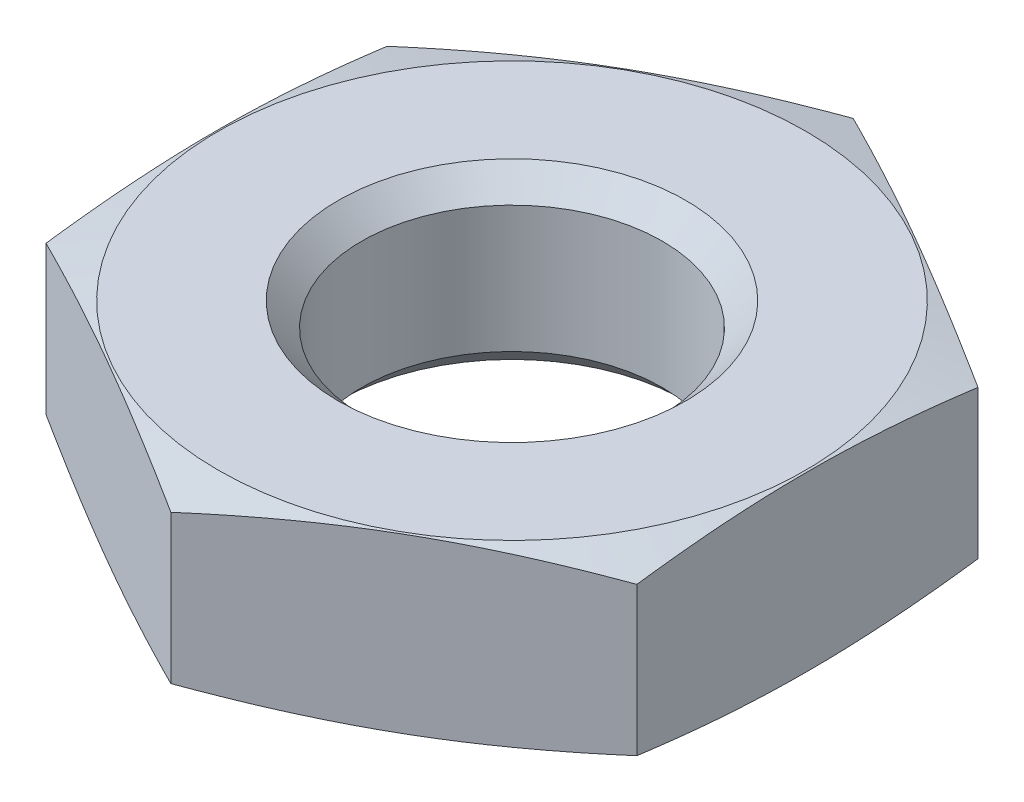
ISO-10303-21;
HEADER;
FILE_DESCRIPTION(('STEP AP214'),'2;1');
FILE_NAME('part.step','',(''),(''),'','','');
FILE_SCHEMA(('AUTOMOTIVE_DESIGN { 1 0 10303 214 1 1 1 1 }'));
ENDSEC;
DATA;
#1=APPLICATION_CONTEXT('core data for automotive mechanical design processes');
#2=APPLICATION_PROTOCOL_DEFINITION('international standard','automotive_design',2000,#1);
#3=PRODUCT_CONTEXT('',#1,'mechanical');
#4=PRODUCT('Part','Part','',(#3));
#5=PRODUCT_RELATED_PRODUCT_CATEGORY('part','',(#4));
#6=PRODUCT_DEFINITION_FORMATION('','',#4);
#7=PRODUCT_DEFINITION_CONTEXT('part definition',#1,'design');
#8=PRODUCT_DEFINITION('design','',#6,#7);
#9=PRODUCT_DEFINITION_SHAPE('','',#8);
#10=(LENGTH_UNIT() NAMED_UNIT(*) SI_UNIT(.MILLI.,.METRE.));
#11=(NAMED_UNIT(*) PLANE_ANGLE_UNIT() SI_UNIT($,.RADIAN.));
#12=(NAMED_UNIT(*) SI_UNIT($,.STERADIAN.) SOLID_ANGLE_UNIT());
#13=UNCERTAINTY_MEASURE_WITH_UNIT(LENGTH_MEASURE(1.E-05),#10,'distance_accuracy_value','');
#14=(GEOMETRIC_REPRESENTATION_CONTEXT(3) GLOBAL_UNCERTAINTY_ASSIGNED_CONTEXT((#13)) GLOBAL_UNIT_ASSIGNED_CONTEXT((#10,
#11,#12)) REPRESENTATION_CONTEXT('',''));
#15=CARTESIAN_POINT('',(0.,0.,0.));
#16=DIRECTION('',(0.,0.,1.));
#17=DIRECTION('',(1.,0.,0.));
#18=AXIS2_PLACEMENT_3D('',#15,#16,#17);
#19=CARTESIAN_POINT('',(0.,-2.5,0.));
#20=DIRECTION('',(0.,-1.,0.));
#21=DIRECTION('',(0.,0.,-1.));
#22=AXIS2_PLACEMENT_3D('',#19,#20,#21);
#23=CONICAL_SURFACE('',#22,17.780127018922,1.30899693899574);
#24=CARTESIAN_POINT('',(0.,0.,0.));
#25=DIRECTION('',(0.,-1.,0.));
#26=DIRECTION('',(0.,0.,-1.));
#27=AXIS2_PLACEMENT_3D('',#24,#25,#26);
#28=CIRCLE('',#27,8.45);
#29=CARTESIAN_POINT('',(0.,0.,-8.45));
#30=VERTEX_POINT('',#29);
#31=EDGE_CURVE('E121',#30,#30,#28,.T.);
#32=ORIENTED_EDGE('',*,*,#31,.T.);
#33=EDGE_LOOP('',(#32));
#34=FACE_BOUND('',#33,.T.);
#35=CARTESIAN_POINT('',(0.000200000000000109,-0.365769417057959,-9.81507004627744));
#36=CARTESIAN_POINT('',(-0.352800229244585,-0.311137500905046,-9.61126526889908));
#37=CARTESIAN_POINT('',(-0.706440481475503,-0.261540764749273,-9.40709097407727));
#38=CARTESIAN_POINT('',(-1.41496987394528,-0.174403984325089,-8.99802133860609));
#39=CARTESIAN_POINT('',(-1.76985946244938,-0.136868837078632,-8.79312573915065));
#40=CARTESIAN_POINT('',(-2.47873586595203,-0.0760464794968255,-8.38385575676622));
#41=CARTESIAN_POINT('',(-2.83271788769515,-0.052686737057327,-8.17948414122454));
#42=CARTESIAN_POINT('',(-3.5411333400369,-0.0213637164939934,-7.77048028911695));
#43=CARTESIAN_POINT('',(-3.89556667001845,-0.0133974596215508,-7.56584811064232));
#44=CARTESIAN_POINT('',(-4.60443332998155,-0.0133974596215514,-7.15658375369308));
#45=CARTESIAN_POINT('',(-4.9588666599631,-0.0213637164939946,-6.95195157521845));
#46=CARTESIAN_POINT('',(-5.66728211230485,-0.0526867370573296,-6.54294772311086));
#47=CARTESIAN_POINT('',(-6.02126413404797,-0.0760464794968291,-6.33857610756918));
#48=CARTESIAN_POINT('',(-6.73014053755062,-0.136868837078638,-5.92930612518475));
#49=CARTESIAN_POINT('',(-7.08503012605472,-0.174403984325095,-5.72441052572931));
#50=CARTESIAN_POINT('',(-7.7935595185245,-0.261540764749279,-5.31534089025813));
#51=CARTESIAN_POINT('',(-8.14719977075542,-0.311137500905053,-5.11116659543632));
#52=CARTESIAN_POINT('',(-8.5002,-0.365769417057967,-4.90736181805796));
#53=B_SPLINE_CURVE_WITH_KNOTS('',3,(#35,#36,#37,#38,#39,#40,#41,#42,#43,#44,#45,#46,#47,#48,#49,
#50,#51,#52),.UNSPECIFIED.,.F.,.F.,(4,2,2,2,2,2,2,2,4),(0.,1.23382789118024,2.46815608714628,
3.69611406802288,4.92383440651826,6.15155474501363,7.37951272589024,8.61384092185627,
9.84766881303652),.UNSPECIFIED.);
#54=CARTESIAN_POINT('',(0.,-0.365738476404288,-9.8149545762236));
#55=VERTEX_POINT('',#54);
#56=CARTESIAN_POINT('',(-8.5,-0.365738476404295,-4.9074772881118));
#57=VERTEX_POINT('',#56);
#58=EDGE_CURVE('E117',#55,#57,#53,.T.);
#59=ORIENTED_EDGE('',*,*,#58,.T.);
#60=CARTESIAN_POINT('',(-8.5,-2.3639247544871,-15.0360203576041));
#61=CARTESIAN_POINT('',(-8.5,-2.27937012825233,-14.6734757623121));
#62=CARTESIAN_POINT('',(-8.5,-2.19549646796284,-14.3107707804528));
#63=CARTESIAN_POINT('',(-8.5,-2.0294208773786,-13.5849725191364));
#64=CARTESIAN_POINT('',(-8.5,-1.94721897348251,-13.2218792336429));
#65=CARTESIAN_POINT('',(-8.5,-1.78478445296961,-12.4951814894489));
#66=CARTESIAN_POINT('',(-8.5,-1.70455220114447,-12.1315769490497));
#67=CARTESIAN_POINT('',(-8.5,-1.54648067543351,-11.4038483267945));
#68=CARTESIAN_POINT('',(-8.5,-1.46864139395058,-11.0397242465918));
#69=CARTESIAN_POINT('',(-8.5,-1.31511895411883,-10.3073340320132));
#70=CARTESIAN_POINT('',(-8.5,-1.23946401682463,-9.93906196641482));
#71=CARTESIAN_POINT('',(-8.5,-1.09175910745215,-9.20179613896365));
#72=CARTESIAN_POINT('',(-8.5,-1.01970910749613,-8.83280238271478));
#73=CARTESIAN_POINT('',(-8.5,-0.880018719786806,-8.09393326140461));
#74=CARTESIAN_POINT('',(-8.5,-0.812378843490324,-7.72405779922671));
#75=CARTESIAN_POINT('',(-8.5,-0.682524066993284,-6.98335024552972));
#76=CARTESIAN_POINT('',(-8.5,-0.620309164849639,-6.61251815435333));
#77=CARTESIAN_POINT('',(-8.5,-0.50413892873905,-5.87997045960093));
#78=CARTESIAN_POINT('',(-8.5,-0.450003961095086,-5.51828353942051));
#79=CARTESIAN_POINT('',(-8.5,-0.349330847237729,-4.79384411222864));
#80=CARTESIAN_POINT('',(-8.5,-0.302792702235557,-4.4310916050473));
#81=CARTESIAN_POINT('',(-8.5,-0.2187650946796,-3.70462077137001));
#82=CARTESIAN_POINT('',(-8.5,-0.181273351458898,-3.3409027117237));
#83=CARTESIAN_POINT('',(-8.5,-0.116770610619293,-2.61254160313833));
#84=CARTESIAN_POINT('',(-8.5,-0.0897591451929583,-2.24789859621755));
#85=CARTESIAN_POINT('',(-8.5,-0.0475541537350256,-1.51956392735025));
#86=CARTESIAN_POINT('',(-8.5,-0.0323080208991871,-1.15587536295004));
#87=CARTESIAN_POINT('',(-8.5,-0.0142192230736951,-0.428186648910902));
#88=CARTESIAN_POINT('',(-8.5,-0.0113764882642169,-0.0641865010374335));
#89=CARTESIAN_POINT('',(-8.5,-0.0182502334673587,0.663718269423194));
#90=CARTESIAN_POINT('',(-8.5,-0.0279675543871868,1.02762288398274));
#91=CARTESIAN_POINT('',(-8.5,-0.0594410430176242,1.75489855726968));
#92=CARTESIAN_POINT('',(-8.5,-0.0811971991364327,2.11826961651048));
#93=CARTESIAN_POINT('',(-8.5,-0.147829156542609,3.00566017974477));
#94=CARTESIAN_POINT('',(-8.5,-0.19868449558031,3.52923079842505));
#95=CARTESIAN_POINT('',(-8.5,-0.319137315402589,4.57413032092251));
#96=CARTESIAN_POINT('',(-8.5,-0.38873430605718,5.09545928300111));
#97=CARTESIAN_POINT('',(-8.5,-0.542670339854274,6.13767893630393));
#98=CARTESIAN_POINT('',(-8.5,-0.627057752776347,6.65856237328509));
#99=CARTESIAN_POINT('',(-8.5,-0.806830622464431,7.69839836943751));
#100=CARTESIAN_POINT('',(-8.5,-0.9022159614066,8.21735094923309));
#101=CARTESIAN_POINT('',(-8.5,-1.10332786619336,9.26458573455643));
#102=CARTESIAN_POINT('',(-8.5,-1.20923006614953,9.79283394970204));
#103=CARTESIAN_POINT('',(-8.5,-1.42747179045802,10.8479976028115));
#104=CARTESIAN_POINT('',(-8.5,-1.53981139317672,11.374913024469));
#105=CARTESIAN_POINT('',(-8.5,-1.76871242996661,12.4246853211046));
#106=CARTESIAN_POINT('',(-8.5,-1.88524623727985,12.947548241208));
#107=CARTESIAN_POINT('',(-8.5,-2.06282540366486,13.7311913891819));
#108=CARTESIAN_POINT('',(-8.5,-2.12247945448448,13.9922883452165));
#109=CARTESIAN_POINT('',(-8.5,-2.2426106848092,14.5142916127147));
#110=CARTESIAN_POINT('',(-8.5,-2.30308786050588,14.7751979250545));
#111=CARTESIAN_POINT('',(-8.5,-2.3639247544871,15.0360203576041));
#112=B_SPLINE_CURVE_WITH_KNOTS('',3,(#60,#61,#62,#63,#64,#65,#66,#67,#68,#69,#70,#71,#72,#73,
#74,#75,#76,#77,#78,#79,#80,#81,#82,#83,#84,#85,#86,#87,#88,#89,#90,#91,#92,#93,#94,#95,#96,#97,
#98,#99,#100,#101,#102,#103,#104,#105,#106,#107,#108,#109,#110,#111),.UNSPECIFIED.,.F.,.F.,(4,2,
2,2,2,2,2,2,2,2,2,2,2,2,2,2,2,2,2,2,2,2,2,2,2,4),(0.,1.11682417611697,2.23366597429916,
3.35071308134477,4.46775664166398,5.59563027187189,6.72349517864314,7.85149065587533,
8.97948572908639,10.0765667669556,11.173647979741,12.270452320321,13.3672076972881,
14.4590302277838,15.5508466123061,16.6427360987194,17.7346245337898,19.3122750761973,
20.8898843640359,22.4727526704249,24.0556040206807,25.6718286623336,27.2880729834416,
28.8951304493104,29.6986044141633,30.5020746627873),.UNSPECIFIED.);
#113=CARTESIAN_POINT('',(-8.5,-0.365738476404295,4.9074772881118));
#114=VERTEX_POINT('',#113);
#115=EDGE_CURVE('E110',#57,#114,#112,.T.);
#116=ORIENTED_EDGE('',*,*,#115,.T.);
#117=CARTESIAN_POINT('',(-8.5002,-0.365769417057967,4.90736181805796));
#118=CARTESIAN_POINT('',(-8.14719977075542,-0.311137500905053,5.11116659543632));
#119=CARTESIAN_POINT('',(-7.7935595185245,-0.261540764749279,5.31534089025813));
#120=CARTESIAN_POINT('',(-7.08503012605472,-0.174403984325094,5.72441052572931));
#121=CARTESIAN_POINT('',(-6.73014053755062,-0.136868837078637,5.92930612518475));
#122=CARTESIAN_POINT('',(-6.02126413404797,-0.0760464794968289,6.33857610756918));
#123=CARTESIAN_POINT('',(-5.66728211230485,-0.05268673705733,6.54294772311086));
#124=CARTESIAN_POINT('',(-4.9588666599631,-0.0213637164939952,6.95195157521845));
#125=CARTESIAN_POINT('',(-4.60443332998155,-0.0133974596215518,7.15658375369308));
#126=CARTESIAN_POINT('',(-3.89556667001845,-0.0133974596215507,7.56584811064232));
#127=CARTESIAN_POINT('',(-3.5411333400369,-0.021363716493993,7.77048028911695));
#128=CARTESIAN_POINT('',(-2.83271788769515,-0.0526867370573266,8.17948414122455));
#129=CARTESIAN_POINT('',(-2.47873586595203,-0.0760464794968255,8.38385575676622));
#130=CARTESIAN_POINT('',(-1.76985946244938,-0.136868837078633,8.79312573915065));
#131=CARTESIAN_POINT('',(-1.41496987394528,-0.174403984325089,8.99802133860609));
#132=CARTESIAN_POINT('',(-0.7064404814755,-0.261540764749272,9.40709097407727));
#133=CARTESIAN_POINT('',(-0.352800229244583,-0.311137500905045,9.61126526889908));
#134=CARTESIAN_POINT('',(0.000200000000002859,-0.36576941705796,9.81507004627744));
#135=B_SPLINE_CURVE_WITH_KNOTS('',3,(#117,#118,#119,#120,#121,#122,#123,#124,#125,#126,#127,
#128,#129,#130,#131,#132,#133,#134),.UNSPECIFIED.,.F.,.F.,(4,2,2,2,2,2,2,2,4),(0.,
1.23382789118024,2.46815608714628,3.69611406802288,4.92383440651826,6.15155474501364,
7.37951272589024,8.61384092185628,9.84766881303652),.UNSPECIFIED.);
#136=CARTESIAN_POINT('',(0.,-0.365738476404288,9.8149545762236));
#137=VERTEX_POINT('',#136);
#138=EDGE_CURVE('E99',#114,#137,#135,.T.);
#139=ORIENTED_EDGE('',*,*,#138,.T.);
#140=CARTESIAN_POINT('',(-0.000200000000000109,-0.365769417057959,9.81507004627744));
#141=CARTESIAN_POINT('',(0.352800229244585,-0.311137500905046,9.61126526889908));
#142=CARTESIAN_POINT('',(0.706440481475503,-0.261540764749273,9.40709097407727));
#143=CARTESIAN_POINT('',(1.41496987394528,-0.174403984325089,8.99802133860609));
#144=CARTESIAN_POINT('',(1.76985946244938,-0.136868837078632,8.79312573915065));
#145=CARTESIAN_POINT('',(2.47873586595203,-0.0760464794968255,8.38385575676622));
#146=CARTESIAN_POINT('',(2.83271788769515,-0.052686737057327,8.17948414122454));
#147=CARTESIAN_POINT('',(3.5411333400369,-0.0213637164939934,7.77048028911695));
#148=CARTESIAN_POINT('',(3.89556667001845,-0.0133974596215508,7.56584811064232));
#149=CARTESIAN_POINT('',(4.60443332998155,-0.0133974596215514,7.15658375369308));
#150=CARTESIAN_POINT('',(4.9588666599631,-0.0213637164939946,6.95195157521845));
#151=CARTESIAN_POINT('',(5.66728211230485,-0.0526867370573296,6.54294772311086));
#152=CARTESIAN_POINT('',(6.02126413404797,-0.0760464794968291,6.33857610756918));
#153=CARTESIAN_POINT('',(6.73014053755062,-0.136868837078638,5.92930612518475));
#154=CARTESIAN_POINT('',(7.08503012605472,-0.174403984325095,5.72441052572931));
#155=CARTESIAN_POINT('',(7.7935595185245,-0.261540764749279,5.31534089025813));
#156=CARTESIAN_POINT('',(8.14719977075542,-0.311137500905053,5.11116659543632));
#157=CARTESIAN_POINT('',(8.5002,-0.365769417057967,4.90736181805796));
#158=B_SPLINE_CURVE_WITH_KNOTS('',3,(#140,#141,#142,#143,#144,#145,#146,#147,#148,#149,#150,
#151,#152,#153,#154,#155,#156,#157),.UNSPECIFIED.,.F.,.F.,(4,2,2,2,2,2,2,2,4),(0.,
1.23382789118024,2.46815608714628,3.69611406802288,4.92383440651826,6.15155474501363,
7.37951272589024,8.61384092185627,9.84766881303652),.UNSPECIFIED.);
#159=CARTESIAN_POINT('',(8.5,-0.365738476404295,4.9074772881118));
#160=VERTEX_POINT('',#159);
#161=EDGE_CURVE('E104',#137,#160,#158,.T.);
#162=ORIENTED_EDGE('',*,*,#161,.T.);
#163=CARTESIAN_POINT('',(8.5,-2.3639247544871,15.0360203576041));
#164=CARTESIAN_POINT('',(8.5,-2.27937012825233,14.6734757623121));
#165=CARTESIAN_POINT('',(8.5,-2.19549646796284,14.3107707804528));
#166=CARTESIAN_POINT('',(8.5,-2.0294208773786,13.5849725191364));
#167=CARTESIAN_POINT('',(8.5,-1.94721897348251,13.2218792336429));
#168=CARTESIAN_POINT('',(8.5,-1.78478445296961,12.4951814894489));
#169=CARTESIAN_POINT('',(8.5,-1.70455220114447,12.1315769490497));
#170=CARTESIAN_POINT('',(8.5,-1.54648067543351,11.4038483267945));
#171=CARTESIAN_POINT('',(8.5,-1.46864139395058,11.0397242465918));
#172=CARTESIAN_POINT('',(8.5,-1.31511895411883,10.3073340320132));
#173=CARTESIAN_POINT('',(8.5,-1.23946401682463,9.93906196641482));
#174=CARTESIAN_POINT('',(8.5,-1.09175910745215,9.20179613896365));
#175=CARTESIAN_POINT('',(8.5,-1.01970910749613,8.83280238271478));
#176=CARTESIAN_POINT('',(8.5,-0.880018719786806,8.09393326140461));
#177=CARTESIAN_POINT('',(8.5,-0.812378843490324,7.72405779922671));
#178=CARTESIAN_POINT('',(8.5,-0.682524066993284,6.98335024552972));
#179=CARTESIAN_POINT('',(8.5,-0.620309164849639,6.61251815435333));
#180=CARTESIAN_POINT('',(8.5,-0.50413892873905,5.87997045960093));
#181=CARTESIAN_POINT('',(8.5,-0.450003961095086,5.51828353942051));
#182=CARTESIAN_POINT('',(8.5,-0.349330847237729,4.79384411222864));
#183=CARTESIAN_POINT('',(8.5,-0.302792702235557,4.4310916050473));
#184=CARTESIAN_POINT('',(8.5,-0.2187650946796,3.70462077137001));
#185=CARTESIAN_POINT('',(8.5,-0.181273351458898,3.3409027117237));
#186=CARTESIAN_POINT('',(8.5,-0.116770610619293,2.61254160313833));
#187=CARTESIAN_POINT('',(8.5,-0.0897591451929583,2.24789859621755));
#188=CARTESIAN_POINT('',(8.5,-0.0475541537350256,1.51956392735025));
#189=CARTESIAN_POINT('',(8.5,-0.0323080208991871,1.15587536295004));
#190=CARTESIAN_POINT('',(8.5,-0.0142192230736951,0.428186648910902));
#191=CARTESIAN_POINT('',(8.5,-0.0113764882642169,0.0641865010374335));
#192=CARTESIAN_POINT('',(8.5,-0.0182502334673587,-0.663718269423194));
#193=CARTESIAN_POINT('',(8.5,-0.0279675543871868,-1.02762288398274));
#194=CARTESIAN_POINT('',(8.5,-0.0594410430176242,-1.75489855726968));
#195=CARTESIAN_POINT('',(8.5,-0.0811971991364327,-2.11826961651048));
#196=CARTESIAN_POINT('',(8.5,-0.147829156542609,-3.00566017974477));
#197=CARTESIAN_POINT('',(8.5,-0.19868449558031,-3.52923079842505));
#198=CARTESIAN_POINT('',(8.5,-0.319137315402589,-4.57413032092251));
#199=CARTESIAN_POINT('',(8.5,-0.38873430605718,-5.09545928300111));
#200=CARTESIAN_POINT('',(8.5,-0.542670339854274,-6.13767893630393));
#201=CARTESIAN_POINT('',(8.5,-0.627057752776347,-6.65856237328509));
#202=CARTESIAN_POINT('',(8.5,-0.806830622464431,-7.69839836943751));
#203=CARTESIAN_POINT('',(8.5,-0.9022159614066,-8.21735094923309));
#204=CARTESIAN_POINT('',(8.5,-1.10332786619336,-9.26458573455643));
#205=CARTESIAN_POINT('',(8.5,-1.20923006614953,-9.79283394970204));
#206=CARTESIAN_POINT('',(8.5,-1.42747179045802,-10.8479976028115));
#207=CARTESIAN_POINT('',(8.5,-1.53981139317672,-11.374913024469));
#208=CARTESIAN_POINT('',(8.5,-1.76871242996661,-12.4246853211046));
#209=CARTESIAN_POINT('',(8.5,-1.88524623727985,-12.947548241208));
#210=CARTESIAN_POINT('',(8.5,-2.06282540366486,-13.7311913891819));
#211=CARTESIAN_POINT('',(8.5,-2.12247945448448,-13.9922883452165));
#212=CARTESIAN_POINT('',(8.5,-2.2426106848092,-14.5142916127147));
#213=CARTESIAN_POINT('',(8.5,-2.30308786050588,-14.7751979250545));
#214=CARTESIAN_POINT('',(8.5,-2.3639247544871,-15.0360203576041));
#215=B_SPLINE_CURVE_WITH_KNOTS('',3,(#163,#164,#165,#166,#167,#168,#169,#170,#171,#172,#173,
#174,#175,#176,#177,#178,#179,#180,#181,#182,#183,#184,#185,#186,#187,#188,#189,#190,#191,#192,
#193,#194,#195,#196,#197,#198,#199,#200,#201,#202,#203,#204,#205,#206,#207,#208,#209,#210,#211,
#212,#213,#214),.UNSPECIFIED.,.F.,.F.,(4,2,2,2,2,2,2,2,2,2,2,2,2,2,2,2,2,2,2,2,2,2,2,2,2,4),(0.,
1.11682417611697,2.23366597429916,3.35071308134477,4.46775664166398,5.59563027187189,
6.72349517864314,7.85149065587533,8.97948572908639,10.0765667669556,11.173647979741,
12.270452320321,13.3672076972881,14.4590302277838,15.5508466123061,16.6427360987194,
17.7346245337898,19.3122750761973,20.8898843640359,22.4727526704249,24.0556040206807,
25.6718286623336,27.2880729834416,28.8951304493104,29.6986044141633,30.5020746627873),.UNSPECIFIED.);
#216=CARTESIAN_POINT('',(8.5,-0.365738476404295,-4.9074772881118));
#217=VERTEX_POINT('',#216);
#218=EDGE_CURVE('E207',#160,#217,#215,.T.);
#219=ORIENTED_EDGE('',*,*,#218,.T.);
#220=CARTESIAN_POINT('',(8.5002,-0.365769417057967,-4.90736181805796));
#221=CARTESIAN_POINT('',(8.14719977075542,-0.311137500905053,-5.11116659543632));
#222=CARTESIAN_POINT('',(7.7935595185245,-0.261540764749279,-5.31534089025813));
#223=CARTESIAN_POINT('',(7.08503012605472,-0.174403984325094,-5.72441052572931));
#224=CARTESIAN_POINT('',(6.73014053755062,-0.136868837078637,-5.92930612518475));
#225=CARTESIAN_POINT('',(6.02126413404797,-0.0760464794968289,-6.33857610756918));
#226=CARTESIAN_POINT('',(5.66728211230485,-0.05268673705733,-6.54294772311086));
#227=CARTESIAN_POINT('',(4.9588666599631,-0.0213637164939952,-6.95195157521845));
#228=CARTESIAN_POINT('',(4.60443332998155,-0.0133974596215518,-7.15658375369308));
#229=CARTESIAN_POINT('',(3.89556667001845,-0.0133974596215507,-7.56584811064232));
#230=CARTESIAN_POINT('',(3.5411333400369,-0.021363716493993,-7.77048028911695));
#231=CARTESIAN_POINT('',(2.83271788769515,-0.0526867370573266,-8.17948414122455));
#232=CARTESIAN_POINT('',(2.47873586595203,-0.0760464794968255,-8.38385575676622));
#233=CARTESIAN_POINT('',(1.76985946244938,-0.136868837078633,-8.79312573915065));
#234=CARTESIAN_POINT('',(1.41496987394528,-0.174403984325089,-8.99802133860609));
#235=CARTESIAN_POINT('',(0.7064404814755,-0.261540764749272,-9.40709097407727));
#236=CARTESIAN_POINT('',(0.352800229244583,-0.311137500905045,-9.61126526889908));
#237=CARTESIAN_POINT('',(-0.000200000000002859,-0.36576941705796,-9.81507004627744));
#238=B_SPLINE_CURVE_WITH_KNOTS('',3,(#220,#221,#222,#223,#224,#225,#226,#227,#228,#229,#230,
#231,#232,#233,#234,#235,#236,#237),.UNSPECIFIED.,.F.,.F.,(4,2,2,2,2,2,2,2,4),(0.,
1.23382789118024,2.46815608714628,3.69611406802288,4.92383440651826,6.15155474501364,
7.37951272589024,8.61384092185628,9.84766881303652),.UNSPECIFIED.);
#239=EDGE_CURVE('E123',#217,#55,#238,.T.);
#240=ORIENTED_EDGE('',*,*,#239,.T.);
#241=EDGE_LOOP('',(#59,#116,#139,#162,#219,#240));
#242=FACE_BOUND('',#241,.T.);
#243=ADVANCED_FACE('F43',(#34,#242),#23,.T.);
#244=CARTESIAN_POINT('',(0.,0.,0.));
#245=DIRECTION('',(0.,1.,0.));
#246=DIRECTION('',(0.,0.,1.));
#247=AXIS2_PLACEMENT_3D('',#244,#245,#246);
#248=PLANE('',#247);
#249=CARTESIAN_POINT('',(0.,0.,0.));
#250=DIRECTION('',(0.,1.,0.));
#251=DIRECTION('',(0.,0.,1.));
#252=AXIS2_PLACEMENT_3D('',#249,#250,#251);
#253=CIRCLE('',#252,5.);
#254=CARTESIAN_POINT('',(0.,0.,5.));
#255=VERTEX_POINT('',#254);
#256=EDGE_CURVE('E113',#255,#255,#253,.T.);
#257=ORIENTED_EDGE('',*,*,#256,.F.);
#258=EDGE_LOOP('',(#257));
#259=FACE_BOUND('',#258,.T.);
#260=ORIENTED_EDGE('',*,*,#31,.F.);
#261=EDGE_LOOP('',(#260));
#262=FACE_BOUND('',#261,.T.);
#263=ADVANCED_FACE('F45',(#259,#262),#248,.T.);
#264=CARTESIAN_POINT('',(-8.5,-6.,-4.9074772881118));
#265=DIRECTION('',(-1.,0.,0.));
#266=DIRECTION('',(0.,0.,1.));
#267=AXIS2_PLACEMENT_3D('',#264,#265,#266);
#268=PLANE('',#267);
#269=DIRECTION('',(0.,1.,0.));
#270=VECTOR('',#269,1.);
#271=CARTESIAN_POINT('',(-8.5,-6.,-4.9074772881118));
#272=LINE('',#271,#270);
#273=CARTESIAN_POINT('',(-8.5,-4.63426152359571,-4.9074772881118));
#274=VERTEX_POINT('',#273);
#275=EDGE_CURVE('E105',#274,#57,#272,.T.);
#276=ORIENTED_EDGE('',*,*,#275,.F.);
#277=CARTESIAN_POINT('',(-8.5,-2.6360752455129,15.0360203576041));
#278=CARTESIAN_POINT('',(-8.5,-2.72062987174767,14.6734757623121));
#279=CARTESIAN_POINT('',(-8.5,-2.80450353203716,14.3107707804528));
#280=CARTESIAN_POINT('',(-8.5,-2.9705791226214,13.5849725191364));
#281=CARTESIAN_POINT('',(-8.5,-3.05278102651749,13.2218792336429));
#282=CARTESIAN_POINT('',(-8.5,-3.21521554703039,12.4951814894489));
#283=CARTESIAN_POINT('',(-8.5,-3.29544779885553,12.1315769490497));
#284=CARTESIAN_POINT('',(-8.5,-3.45351932456649,11.4038483267945));
#285=CARTESIAN_POINT('',(-8.5,-3.53135860604942,11.0397242465918));
#286=CARTESIAN_POINT('',(-8.5,-3.68488104588117,10.3073340320132));
#287=CARTESIAN_POINT('',(-8.5,-3.76053598317537,9.93906196641482));
#288=CARTESIAN_POINT('',(-8.5,-3.90824089254785,9.20179613896365));
#289=CARTESIAN_POINT('',(-8.5,-3.98029089250387,8.83280238271478));
#290=CARTESIAN_POINT('',(-8.5,-4.11998128021319,8.09393326140461));
#291=CARTESIAN_POINT('',(-8.5,-4.18762115650968,7.72405779922671));
#292=CARTESIAN_POINT('',(-8.5,-4.31747593300672,6.98335024552972));
#293=CARTESIAN_POINT('',(-8.5,-4.37969083515036,6.61251815435333));
#294=CARTESIAN_POINT('',(-8.5,-4.49586107126095,5.87997045960093));
#295=CARTESIAN_POINT('',(-8.5,-4.54999603890492,5.51828353942051));
#296=CARTESIAN_POINT('',(-8.5,-4.65066915276227,4.79384411222864));
#297=CARTESIAN_POINT('',(-8.5,-4.69720729776444,4.43109160504731));
#298=CARTESIAN_POINT('',(-8.5,-4.7812349053204,3.70462077137001));
#299=CARTESIAN_POINT('',(-8.5,-4.8187266485411,3.34090271172371));
#300=CARTESIAN_POINT('',(-8.5,-4.88322938938071,2.61254160313833));
#301=CARTESIAN_POINT('',(-8.5,-4.91024085480704,2.24789859621756));
#302=CARTESIAN_POINT('',(-8.5,-4.95244584626498,1.51956392735025));
#303=CARTESIAN_POINT('',(-8.5,-4.96769197910081,1.15587536295004));
#304=CARTESIAN_POINT('',(-8.5,-4.98578077692631,0.428186648910902));
#305=CARTESIAN_POINT('',(-8.5,-4.98862351173578,0.0641865010374339));
#306=CARTESIAN_POINT('',(-8.5,-4.98174976653264,-0.663718269423194));
#307=CARTESIAN_POINT('',(-8.5,-4.97203244561281,-1.02762288398275));
#308=CARTESIAN_POINT('',(-8.5,-4.94055895698238,-1.75489855726968));
#309=CARTESIAN_POINT('',(-8.5,-4.91880280086357,-2.11826961651048));
#310=CARTESIAN_POINT('',(-8.5,-4.85217084345739,-3.00566017974477));
#311=CARTESIAN_POINT('',(-8.5,-4.80131550441969,-3.52923079842505));
#312=CARTESIAN_POINT('',(-8.5,-4.68086268459741,-4.57413032092251));
#313=CARTESIAN_POINT('',(-8.5,-4.61126569394282,-5.09545928300111));
#314=CARTESIAN_POINT('',(-8.5,-4.45732966014573,-6.13767893630393));
#315=CARTESIAN_POINT('',(-8.5,-4.37294224722365,-6.65856237328509));
#316=CARTESIAN_POINT('',(-8.5,-4.19316937753557,-7.69839836943751));
#317=CARTESIAN_POINT('',(-8.5,-4.0977840385934,-8.21735094923309));
#318=CARTESIAN_POINT('',(-8.5,-3.89667213380664,-9.26458573455643));
#319=CARTESIAN_POINT('',(-8.5,-3.79076993385047,-9.79283394970204));
#320=CARTESIAN_POINT('',(-8.5,-3.57252820954198,-10.8479976028115));
#321=CARTESIAN_POINT('',(-8.5,-3.46018860682328,-11.374913024469));
#322=CARTESIAN_POINT('',(-8.5,-3.23128757003339,-12.4246853211046));
#323=CARTESIAN_POINT('',(-8.5,-3.11475376272015,-12.947548241208));
#324=CARTESIAN_POINT('',(-8.5,-2.93717459633514,-13.7311913891819));
#325=CARTESIAN_POINT('',(-8.5,-2.87752054551552,-13.9922883452165));
#326=CARTESIAN_POINT('',(-8.5,-2.75738931519081,-14.5142916127147));
#327=CARTESIAN_POINT('',(-8.5,-2.69691213949412,-14.7751979250545));
#328=CARTESIAN_POINT('',(-8.5,-2.6360752455129,-15.0360203576041));
#329=B_SPLINE_CURVE_WITH_KNOTS('',3,(#277,#278,#279,#280,#281,#282,#283,#284,#285,#286,#287,
#288,#289,#290,#291,#292,#293,#294,#295,#296,#297,#298,#299,#300,#301,#302,#303,#304,#305,#306,
#307,#308,#309,#310,#311,#312,#313,#314,#315,#316,#317,#318,#319,#320,#321,#322,#323,#324,#325,
#326,#327,#328),.UNSPECIFIED.,.F.,.F.,(4,2,2,2,2,2,2,2,2,2,2,2,2,2,2,2,2,2,2,2,2,2,2,2,2,4),(0.,
1.11682417611697,2.23366597429916,3.35071308134477,4.46775664166398,5.59563027187189,
6.72349517864314,7.85149065587533,8.97948572908639,10.0765667669556,11.173647979741,
12.270452320321,13.3672076972881,14.4590302277838,15.5508466123061,16.6427360987194,
17.7346245337898,19.3122750761973,20.8898843640358,22.4727526704249,24.0556040206807,
25.6718286623336,27.2880729834416,28.8951304493104,29.6986044141633,30.5020746627873),.UNSPECIFIED.);
#330=CARTESIAN_POINT('',(-8.5,-4.63426152359571,4.9074772881118));
#331=VERTEX_POINT('',#330);
#332=EDGE_CURVE('E11',#331,#274,#329,.T.);
#333=ORIENTED_EDGE('',*,*,#332,.F.);
#334=DIRECTION('',(0.,1.,0.));
#335=VECTOR('',#334,1.);
#336=CARTESIAN_POINT('',(-8.5,-6.,4.9074772881118));
#337=LINE('',#336,#335);
#338=EDGE_CURVE('E69',#331,#114,#337,.T.);
#339=ORIENTED_EDGE('',*,*,#338,.T.);
#340=ORIENTED_EDGE('',*,*,#115,.F.);
#341=EDGE_LOOP('',(#276,#333,#339,#340));
#342=FACE_BOUND('',#341,.T.);
#343=ADVANCED_FACE('F109',(#342),#268,.T.);
#344=CARTESIAN_POINT('',(0.,-6.,-9.8149545762236));
#345=DIRECTION('',(-0.499999999999999,0.,-0.866025403784439));
#346=DIRECTION('',(-0.866025403784439,0.,0.499999999999999));
#347=AXIS2_PLACEMENT_3D('',#344,#345,#346);
#348=PLANE('',#347);
#349=DIRECTION('',(0.,1.,0.));
#350=VECTOR('',#349,1.);
#351=CARTESIAN_POINT('',(0.,-6.,-9.8149545762236));
#352=LINE('',#351,#350);
#353=CARTESIAN_POINT('',(0.,-4.63426152359571,-9.8149545762236));
#354=VERTEX_POINT('',#353);
#355=EDGE_CURVE('E248',#354,#55,#352,.T.);
#356=ORIENTED_EDGE('',*,*,#355,.F.);
#357=CARTESIAN_POINT('',(-8.5002,-4.63423058294203,-4.90736181805796));
#358=CARTESIAN_POINT('',(-8.14719977075542,-4.68886249909495,-5.11116659543632));
#359=CARTESIAN_POINT('',(-7.7935595185245,-4.73845923525072,-5.31534089025813));
#360=CARTESIAN_POINT('',(-7.08503012605472,-4.82559601567491,-5.72441052572931));
#361=CARTESIAN_POINT('',(-6.73014053755062,-4.86313116292136,-5.92930612518475));
#362=CARTESIAN_POINT('',(-6.02126413404797,-4.92395352050317,-6.33857610756918));
#363=CARTESIAN_POINT('',(-5.66728211230485,-4.94731326294267,-6.54294772311086));
#364=CARTESIAN_POINT('',(-4.9588666599631,-4.97863628350601,-6.95195157521845));
#365=CARTESIAN_POINT('',(-4.60443332998155,-4.98660254037845,-7.15658375369308));
#366=CARTESIAN_POINT('',(-3.89556667001845,-4.98660254037845,-7.56584811064232));
#367=CARTESIAN_POINT('',(-3.5411333400369,-4.97863628350601,-7.77048028911695));
#368=CARTESIAN_POINT('',(-2.83271788769515,-4.94731326294267,-8.17948414122454));
#369=CARTESIAN_POINT('',(-2.47873586595203,-4.92395352050318,-8.38385575676622));
#370=CARTESIAN_POINT('',(-1.76985946244938,-4.86313116292137,-8.79312573915065));
#371=CARTESIAN_POINT('',(-1.41496987394528,-4.82559601567491,-8.99802133860609));
#372=CARTESIAN_POINT('',(-0.706440481475501,-4.73845923525073,-9.40709097407727));
#373=CARTESIAN_POINT('',(-0.352800229244584,-4.68886249909496,-9.61126526889908));
#374=CARTESIAN_POINT('',(0.00020000000000279,-4.63423058294204,-9.81507004627744));
#375=B_SPLINE_CURVE_WITH_KNOTS('',3,(#357,#358,#359,#360,#361,#362,#363,#364,#365,#366,#367,
#368,#369,#370,#371,#372,#373,#374),.UNSPECIFIED.,.F.,.F.,(4,2,2,2,2,2,2,2,4),(0.,
1.23382789118024,2.46815608714628,3.69611406802288,4.92383440651826,6.15155474501364,
7.37951272589024,8.61384092185628,9.84766881303652),.UNSPECIFIED.);
#376=EDGE_CURVE('E57',#274,#354,#375,.T.);
#377=ORIENTED_EDGE('',*,*,#376,.F.);
#378=ORIENTED_EDGE('',*,*,#275,.T.);
#379=ORIENTED_EDGE('',*,*,#58,.F.);
#380=EDGE_LOOP('',(#356,#377,#378,#379));
#381=FACE_BOUND('',#380,.T.);
#382=ADVANCED_FACE('F141',(#381),#348,.T.);
#383=CARTESIAN_POINT('',(8.5,-6.,-4.9074772881118));
#384=DIRECTION('',(0.499999999999999,0.,-0.866025403784439));
#385=DIRECTION('',(-0.866025403784439,0.,-0.499999999999999));
#386=AXIS2_PLACEMENT_3D('',#383,#384,#385);
#387=PLANE('',#386);
#388=DIRECTION('',(0.,1.,0.));
#389=VECTOR('',#388,1.);
#390=CARTESIAN_POINT('',(8.5,-6.,-4.9074772881118));
#391=LINE('',#390,#389);
#392=CARTESIAN_POINT('',(8.5,-4.63426152359571,-4.9074772881118));
#393=VERTEX_POINT('',#392);
#394=EDGE_CURVE('E250',#393,#217,#391,.T.);
#395=ORIENTED_EDGE('',*,*,#394,.F.);
#396=CARTESIAN_POINT('',(-0.0002,-4.63423058294204,-9.81507004627744));
#397=CARTESIAN_POINT('',(0.352800229244586,-4.68886249909496,-9.61126526889908));
#398=CARTESIAN_POINT('',(0.706440481475503,-4.73845923525073,-9.40709097407727));
#399=CARTESIAN_POINT('',(1.41496987394528,-4.82559601567491,-8.99802133860609));
#400=CARTESIAN_POINT('',(1.76985946244938,-4.86313116292137,-8.79312573915065));
#401=CARTESIAN_POINT('',(2.47873586595203,-4.92395352050318,-8.38385575676622));
#402=CARTESIAN_POINT('',(2.83271788769515,-4.94731326294268,-8.17948414122454));
#403=CARTESIAN_POINT('',(3.5411333400369,-4.97863628350601,-7.77048028911695));
#404=CARTESIAN_POINT('',(3.89556667001845,-4.98660254037845,-7.56584811064232));
#405=CARTESIAN_POINT('',(4.60443332998155,-4.98660254037845,-7.15658375369308));
#406=CARTESIAN_POINT('',(4.9588666599631,-4.97863628350601,-6.95195157521845));
#407=CARTESIAN_POINT('',(5.66728211230485,-4.94731326294267,-6.54294772311086));
#408=CARTESIAN_POINT('',(6.02126413404797,-4.92395352050317,-6.33857610756918));
#409=CARTESIAN_POINT('',(6.73014053755062,-4.86313116292136,-5.92930612518475));
#410=CARTESIAN_POINT('',(7.08503012605472,-4.82559601567491,-5.72441052572931));
#411=CARTESIAN_POINT('',(7.7935595185245,-4.73845923525072,-5.31534089025813));
#412=CARTESIAN_POINT('',(8.14719977075542,-4.68886249909495,-5.11116659543632));
#413=CARTESIAN_POINT('',(8.5002,-4.63423058294203,-4.90736181805796));
#414=B_SPLINE_CURVE_WITH_KNOTS('',3,(#396,#397,#398,#399,#400,#401,#402,#403,#404,#405,#406,
#407,#408,#409,#410,#411,#412,#413),.UNSPECIFIED.,.F.,.F.,(4,2,2,2,2,2,2,2,4),(0.,
1.23382789118024,2.46815608714628,3.69611406802288,4.92383440651826,6.15155474501364,
7.37951272589024,8.61384092185627,9.84766881303652),.UNSPECIFIED.);
#415=EDGE_CURVE('E178',#354,#393,#414,.T.);
#416=ORIENTED_EDGE('',*,*,#415,.F.);
#417=ORIENTED_EDGE('',*,*,#355,.T.);
#418=ORIENTED_EDGE('',*,*,#239,.F.);
#419=EDGE_LOOP('',(#395,#416,#417,#418));
#420=FACE_BOUND('',#419,.T.);
#421=ADVANCED_FACE('F192',(#420),#387,.T.);
#422=CARTESIAN_POINT('',(8.5,-6.,4.9074772881118));
#423=DIRECTION('',(1.,0.,0.));
#424=DIRECTION('',(0.,0.,-1.));
#425=AXIS2_PLACEMENT_3D('',#422,#423,#424);
#426=PLANE('',#425);
#427=DIRECTION('',(0.,1.,0.));
#428=VECTOR('',#427,1.);
#429=CARTESIAN_POINT('',(8.5,-6.,4.9074772881118));
#430=LINE('',#429,#428);
#431=CARTESIAN_POINT('',(8.5,-4.63426152359571,4.9074772881118));
#432=VERTEX_POINT('',#431);
#433=EDGE_CURVE('E253',#432,#160,#430,.T.);
#434=ORIENTED_EDGE('',*,*,#433,.F.);
#435=CARTESIAN_POINT('',(8.5,-2.6360752455129,-15.0360203576041));
#436=CARTESIAN_POINT('',(8.5,-2.72062987174767,-14.6734757623121));
#437=CARTESIAN_POINT('',(8.5,-2.80450353203716,-14.3107707804528));
#438=CARTESIAN_POINT('',(8.5,-2.9705791226214,-13.5849725191364));
#439=CARTESIAN_POINT('',(8.5,-3.05278102651749,-13.2218792336429));
#440=CARTESIAN_POINT('',(8.5,-3.21521554703039,-12.4951814894489));
#441=CARTESIAN_POINT('',(8.5,-3.29544779885553,-12.1315769490497));
#442=CARTESIAN_POINT('',(8.5,-3.45351932456649,-11.4038483267945));
#443=CARTESIAN_POINT('',(8.5,-3.53135860604942,-11.0397242465918));
#444=CARTESIAN_POINT('',(8.5,-3.68488104588117,-10.3073340320132));
#445=CARTESIAN_POINT('',(8.5,-3.76053598317537,-9.93906196641482));
#446=CARTESIAN_POINT('',(8.5,-3.90824089254785,-9.20179613896365));
#447=CARTESIAN_POINT('',(8.5,-3.98029089250387,-8.83280238271478));
#448=CARTESIAN_POINT('',(8.5,-4.11998128021319,-8.09393326140461));
#449=CARTESIAN_POINT('',(8.5,-4.18762115650968,-7.72405779922671));
#450=CARTESIAN_POINT('',(8.5,-4.31747593300672,-6.98335024552972));
#451=CARTESIAN_POINT('',(8.5,-4.37969083515036,-6.61251815435333));
#452=CARTESIAN_POINT('',(8.5,-4.49586107126095,-5.87997045960093));
#453=CARTESIAN_POINT('',(8.5,-4.54999603890492,-5.51828353942051));
#454=CARTESIAN_POINT('',(8.5,-4.65066915276227,-4.79384411222864));
#455=CARTESIAN_POINT('',(8.5,-4.69720729776444,-4.43109160504731));
#456=CARTESIAN_POINT('',(8.5,-4.7812349053204,-3.70462077137001));
#457=CARTESIAN_POINT('',(8.5,-4.8187266485411,-3.34090271172371));
#458=CARTESIAN_POINT('',(8.5,-4.88322938938071,-2.61254160313833));
#459=CARTESIAN_POINT('',(8.5,-4.91024085480704,-2.24789859621756));
#460=CARTESIAN_POINT('',(8.5,-4.95244584626498,-1.51956392735025));
#461=CARTESIAN_POINT('',(8.5,-4.96769197910081,-1.15587536295004));
#462=CARTESIAN_POINT('',(8.5,-4.98578077692631,-0.428186648910902));
#463=CARTESIAN_POINT('',(8.5,-4.98862351173578,-0.0641865010374339));
#464=CARTESIAN_POINT('',(8.5,-4.98174976653264,0.663718269423194));
#465=CARTESIAN_POINT('',(8.5,-4.97203244561281,1.02762288398275));
#466=CARTESIAN_POINT('',(8.5,-4.94055895698238,1.75489855726968));
#467=CARTESIAN_POINT('',(8.5,-4.91880280086357,2.11826961651048));
#468=CARTESIAN_POINT('',(8.5,-4.85217084345739,3.00566017974477));
#469=CARTESIAN_POINT('',(8.5,-4.80131550441969,3.52923079842505));
#470=CARTESIAN_POINT('',(8.5,-4.68086268459741,4.57413032092251));
#471=CARTESIAN_POINT('',(8.5,-4.61126569394282,5.09545928300111));
#472=CARTESIAN_POINT('',(8.5,-4.45732966014573,6.13767893630393));
#473=CARTESIAN_POINT('',(8.5,-4.37294224722365,6.65856237328509));
#474=CARTESIAN_POINT('',(8.5,-4.19316937753557,7.69839836943751));
#475=CARTESIAN_POINT('',(8.5,-4.0977840385934,8.21735094923309));
#476=CARTESIAN_POINT('',(8.5,-3.89667213380664,9.26458573455643));
#477=CARTESIAN_POINT('',(8.5,-3.79076993385047,9.79283394970204));
#478=CARTESIAN_POINT('',(8.5,-3.57252820954198,10.8479976028115));
#479=CARTESIAN_POINT('',(8.5,-3.46018860682328,11.374913024469));
#480=CARTESIAN_POINT('',(8.5,-3.23128757003339,12.4246853211046));
#481=CARTESIAN_POINT('',(8.5,-3.11475376272015,12.947548241208));
#482=CARTESIAN_POINT('',(8.5,-2.93717459633514,13.7311913891819));
#483=CARTESIAN_POINT('',(8.5,-2.87752054551552,13.9922883452165));
#484=CARTESIAN_POINT('',(8.5,-2.75738931519081,14.5142916127147));
#485=CARTESIAN_POINT('',(8.5,-2.69691213949412,14.7751979250545));
#486=CARTESIAN_POINT('',(8.5,-2.6360752455129,15.0360203576041));
#487=B_SPLINE_CURVE_WITH_KNOTS('',3,(#435,#436,#437,#438,#439,#440,#441,#442,#443,#444,#445,
#446,#447,#448,#449,#450,#451,#452,#453,#454,#455,#456,#457,#458,#459,#460,#461,#462,#463,#464,
#465,#466,#467,#468,#469,#470,#471,#472,#473,#474,#475,#476,#477,#478,#479,#480,#481,#482,#483,
#484,#485,#486),.UNSPECIFIED.,.F.,.F.,(4,2,2,2,2,2,2,2,2,2,2,2,2,2,2,2,2,2,2,2,2,2,2,2,2,4),(0.,
1.11682417611697,2.23366597429916,3.35071308134477,4.46775664166398,5.59563027187189,
6.72349517864314,7.85149065587533,8.97948572908639,10.0765667669556,11.173647979741,
12.270452320321,13.3672076972881,14.4590302277838,15.5508466123061,16.6427360987194,
17.7346245337898,19.3122750761973,20.8898843640358,22.4727526704249,24.0556040206807,
25.6718286623336,27.2880729834416,28.8951304493104,29.6986044141633,30.5020746627873),.UNSPECIFIED.);
#488=EDGE_CURVE('E171',#393,#432,#487,.T.);
#489=ORIENTED_EDGE('',*,*,#488,.F.);
#490=ORIENTED_EDGE('',*,*,#394,.T.);
#491=ORIENTED_EDGE('',*,*,#218,.F.);
#492=EDGE_LOOP('',(#434,#489,#490,#491));
#493=FACE_BOUND('',#492,.T.);
#494=ADVANCED_FACE('F198',(#493),#426,.T.);
#495=CARTESIAN_POINT('',(0.,-6.,9.8149545762236));
#496=DIRECTION('',(0.499999999999999,0.,0.866025403784439));
#497=DIRECTION('',(0.866025403784439,0.,-0.499999999999999));
#498=AXIS2_PLACEMENT_3D('',#495,#496,#497);
#499=PLANE('',#498);
#500=DIRECTION('',(0.,1.,0.));
#501=VECTOR('',#500,1.);
#502=CARTESIAN_POINT('',(0.,-6.,9.8149545762236));
#503=LINE('',#502,#501);
#504=CARTESIAN_POINT('',(0.,-4.63426152359571,9.8149545762236));
#505=VERTEX_POINT('',#504);
#506=EDGE_CURVE('E64',#505,#137,#503,.T.);
#507=ORIENTED_EDGE('',*,*,#506,.F.);
#508=CARTESIAN_POINT('',(8.5002,-4.63423058294203,4.90736181805796));
#509=CARTESIAN_POINT('',(8.14719977075542,-4.68886249909495,5.11116659543632));
#510=CARTESIAN_POINT('',(7.7935595185245,-4.73845923525072,5.31534089025813));
#511=CARTESIAN_POINT('',(7.08503012605472,-4.82559601567491,5.72441052572931));
#512=CARTESIAN_POINT('',(6.73014053755062,-4.86313116292136,5.92930612518475));
#513=CARTESIAN_POINT('',(6.02126413404797,-4.92395352050317,6.33857610756918));
#514=CARTESIAN_POINT('',(5.66728211230485,-4.94731326294267,6.54294772311086));
#515=CARTESIAN_POINT('',(4.9588666599631,-4.97863628350601,6.95195157521845));
#516=CARTESIAN_POINT('',(4.60443332998155,-4.98660254037845,7.15658375369308));
#517=CARTESIAN_POINT('',(3.89556667001845,-4.98660254037845,7.56584811064232));
#518=CARTESIAN_POINT('',(3.5411333400369,-4.97863628350601,7.77048028911695));
#519=CARTESIAN_POINT('',(2.83271788769515,-4.94731326294267,8.17948414122454));
#520=CARTESIAN_POINT('',(2.47873586595203,-4.92395352050318,8.38385575676622));
#521=CARTESIAN_POINT('',(1.76985946244938,-4.86313116292137,8.79312573915065));
#522=CARTESIAN_POINT('',(1.41496987394528,-4.82559601567491,8.99802133860609));
#523=CARTESIAN_POINT('',(0.706440481475501,-4.73845923525073,9.40709097407727));
#524=CARTESIAN_POINT('',(0.352800229244584,-4.68886249909496,9.61126526889908));
#525=CARTESIAN_POINT('',(-0.00020000000000279,-4.63423058294204,9.81507004627744));
#526=B_SPLINE_CURVE_WITH_KNOTS('',3,(#508,#509,#510,#511,#512,#513,#514,#515,#516,#517,#518,
#519,#520,#521,#522,#523,#524,#525),.UNSPECIFIED.,.F.,.F.,(4,2,2,2,2,2,2,2,4),(0.,
1.23382789118024,2.46815608714628,3.69611406802288,4.92383440651826,6.15155474501364,
7.37951272589024,8.61384092185628,9.84766881303652),.UNSPECIFIED.);
#527=EDGE_CURVE('E164',#432,#505,#526,.T.);
#528=ORIENTED_EDGE('',*,*,#527,.F.);
#529=ORIENTED_EDGE('',*,*,#433,.T.);
#530=ORIENTED_EDGE('',*,*,#161,.F.);
#531=EDGE_LOOP('',(#507,#528,#529,#530));
#532=FACE_BOUND('',#531,.T.);
#533=ADVANCED_FACE('F222',(#532),#499,.T.);
#534=CARTESIAN_POINT('',(-8.5,-6.,4.9074772881118));
#535=DIRECTION('',(-0.499999999999999,0.,0.866025403784439));
#536=DIRECTION('',(0.866025403784439,0.,0.499999999999999));
#537=AXIS2_PLACEMENT_3D('',#534,#535,#536);
#538=PLANE('',#537);
#539=ORIENTED_EDGE('',*,*,#338,.F.);
#540=CARTESIAN_POINT('',(0.0002,-4.63423058294204,9.81507004627744));
#541=CARTESIAN_POINT('',(-0.352800229244586,-4.68886249909496,9.61126526889908));
#542=CARTESIAN_POINT('',(-0.706440481475503,-4.73845923525073,9.40709097407727));
#543=CARTESIAN_POINT('',(-1.41496987394528,-4.82559601567491,8.99802133860609));
#544=CARTESIAN_POINT('',(-1.76985946244938,-4.86313116292137,8.79312573915065));
#545=CARTESIAN_POINT('',(-2.47873586595203,-4.92395352050318,8.38385575676622));
#546=CARTESIAN_POINT('',(-2.83271788769515,-4.94731326294268,8.17948414122454));
#547=CARTESIAN_POINT('',(-3.5411333400369,-4.97863628350601,7.77048028911695));
#548=CARTESIAN_POINT('',(-3.89556667001845,-4.98660254037845,7.56584811064232));
#549=CARTESIAN_POINT('',(-4.60443332998155,-4.98660254037845,7.15658375369308));
#550=CARTESIAN_POINT('',(-4.9588666599631,-4.97863628350601,6.95195157521845));
#551=CARTESIAN_POINT('',(-5.66728211230485,-4.94731326294267,6.54294772311086));
#552=CARTESIAN_POINT('',(-6.02126413404797,-4.92395352050317,6.33857610756918));
#553=CARTESIAN_POINT('',(-6.73014053755062,-4.86313116292136,5.92930612518475));
#554=CARTESIAN_POINT('',(-7.08503012605472,-4.82559601567491,5.72441052572931));
#555=CARTESIAN_POINT('',(-7.7935595185245,-4.73845923525072,5.31534089025813));
#556=CARTESIAN_POINT('',(-8.14719977075542,-4.68886249909495,5.11116659543632));
#557=CARTESIAN_POINT('',(-8.5002,-4.63423058294203,4.90736181805796));
#558=B_SPLINE_CURVE_WITH_KNOTS('',3,(#540,#541,#542,#543,#544,#545,#546,#547,#548,#549,#550,
#551,#552,#553,#554,#555,#556,#557),.UNSPECIFIED.,.F.,.F.,(4,2,2,2,2,2,2,2,4),(0.,
1.23382789118024,2.46815608714628,3.69611406802288,4.92383440651826,6.15155474501364,
7.37951272589024,8.61384092185627,9.84766881303652),.UNSPECIFIED.);
#559=EDGE_CURVE('E156',#505,#331,#558,.T.);
#560=ORIENTED_EDGE('',*,*,#559,.F.);
#561=ORIENTED_EDGE('',*,*,#506,.T.);
#562=ORIENTED_EDGE('',*,*,#138,.F.);
#563=EDGE_LOOP('',(#539,#560,#561,#562));
#564=FACE_BOUND('',#563,.T.);
#565=ADVANCED_FACE('F100',(#564),#538,.T.);
#566=CARTESIAN_POINT('',(8.45,-5.,0.));
#567=DIRECTION('',(0.,-1.,0.));
#568=DIRECTION('',(0.,0.,-1.));
#569=AXIS2_PLACEMENT_3D('',#566,#567,#568);
#570=PLANE('',#569);
#571=CARTESIAN_POINT('',(0.,-5.,0.));
#572=DIRECTION('',(0.,1.,0.));
#573=DIRECTION('',(0.,0.,1.));
#574=AXIS2_PLACEMENT_3D('',#571,#572,#573);
#575=CIRCLE('',#574,5.);
#576=CARTESIAN_POINT('',(0.,-5.,5.));
#577=VERTEX_POINT('',#576);
#578=EDGE_CURVE('E268',#577,#577,#575,.T.);
#579=ORIENTED_EDGE('',*,*,#578,.T.);
#580=EDGE_LOOP('',(#579));
#581=FACE_BOUND('',#580,.T.);
#582=CARTESIAN_POINT('',(0.,-5.,0.));
#583=DIRECTION('',(0.,-1.,0.));
#584=DIRECTION('',(0.,0.,-1.));
#585=AXIS2_PLACEMENT_3D('',#582,#583,#584);
#586=CIRCLE('',#585,8.45);
#587=CARTESIAN_POINT('',(0.,-5.,-8.45));
#588=VERTEX_POINT('',#587);
#589=EDGE_CURVE('E118',#588,#588,#586,.T.);
#590=ORIENTED_EDGE('',*,*,#589,.T.);
#591=EDGE_LOOP('',(#590));
#592=FACE_BOUND('',#591,.T.);
#593=ADVANCED_FACE('F144',(#581,#592),#570,.T.);
#594=CARTESIAN_POINT('',(0.,-5.,0.));
#595=DIRECTION('',(0.,1.,0.));
#596=DIRECTION('',(0.,0.,1.));
#597=AXIS2_PLACEMENT_3D('',#594,#595,#596);
#598=CONICAL_SURFACE('',#597,8.45,1.30899693899574);
#599=ORIENTED_EDGE('',*,*,#589,.F.);
#600=EDGE_LOOP('',(#599));
#601=FACE_BOUND('',#600,.T.);
#602=ORIENTED_EDGE('',*,*,#559,.T.);
#603=ORIENTED_EDGE('',*,*,#332,.T.);
#604=ORIENTED_EDGE('',*,*,#376,.T.);
#605=ORIENTED_EDGE('',*,*,#415,.T.);
#606=ORIENTED_EDGE('',*,*,#488,.T.);
#607=ORIENTED_EDGE('',*,*,#527,.T.);
#608=EDGE_LOOP('',(#602,#603,#604,#605,#606,#607));
#609=FACE_BOUND('',#608,.T.);
#610=ADVANCED_FACE('F147',(#601,#609),#598,.T.);
#611=CARTESIAN_POINT('',(0.,-0.6765,0.));
#612=DIRECTION('',(0.,1.,0.));
#613=DIRECTION('',(0.,0.,1.));
#614=AXIS2_PLACEMENT_3D('',#611,#612,#613);
#615=CONICAL_SURFACE('',#614,4.3235,0.785398163397448);
#616=ORIENTED_EDGE('',*,*,#256,.T.);
#617=EDGE_LOOP('',(#616));
#618=FACE_BOUND('',#617,.T.);
#619=CARTESIAN_POINT('',(0.,-0.6765,0.));
#620=DIRECTION('',(0.,1.,0.));
#621=DIRECTION('',(0.,0.,1.));
#622=AXIS2_PLACEMENT_3D('',#619,#620,#621);
#623=CIRCLE('',#622,4.3235);
#624=CARTESIAN_POINT('',(0.,-0.6765,4.3235));
#625=VERTEX_POINT('',#624);
#626=EDGE_CURVE('E262',#625,#625,#623,.T.);
#627=ORIENTED_EDGE('',*,*,#626,.F.);
#628=EDGE_LOOP('',(#627));
#629=FACE_BOUND('',#628,.T.);
#630=ADVANCED_FACE('F151',(#618,#629),#615,.F.);
#631=CARTESIAN_POINT('',(0.,-5.,0.));
#632=DIRECTION('',(0.,1.,0.));
#633=DIRECTION('',(0.,0.,1.));
#634=AXIS2_PLACEMENT_3D('',#631,#632,#633);
#635=CYLINDRICAL_SURFACE('',#634,4.3235);
#636=ORIENTED_EDGE('',*,*,#626,.T.);
#637=EDGE_LOOP('',(#636));
#638=FACE_BOUND('',#637,.T.);
#639=CARTESIAN_POINT('',(0.,-4.3235,0.));
#640=DIRECTION('',(0.,1.,0.));
#641=DIRECTION('',(0.,0.,1.));
#642=AXIS2_PLACEMENT_3D('',#639,#640,#641);
#643=CIRCLE('',#642,4.3235);
#644=CARTESIAN_POINT('',(0.,-4.3235,4.3235));
#645=VERTEX_POINT('',#644);
#646=EDGE_CURVE('E265',#645,#645,#643,.T.);
#647=ORIENTED_EDGE('',*,*,#646,.F.);
#648=EDGE_LOOP('',(#647));
#649=FACE_BOUND('',#648,.T.);
#650=ADVANCED_FACE('F275',(#638,#649),#635,.F.);
#651=CARTESIAN_POINT('',(0.,-5.,0.));
#652=DIRECTION('',(0.,-1.,0.));
#653=DIRECTION('',(0.,0.,-1.));
#654=AXIS2_PLACEMENT_3D('',#651,#652,#653);
#655=CONICAL_SURFACE('',#654,5.,0.785398163397448);
#656=ORIENTED_EDGE('',*,*,#646,.T.);
#657=EDGE_LOOP('',(#656));
#658=FACE_BOUND('',#657,.T.);
#659=ORIENTED_EDGE('',*,*,#578,.F.);
#660=EDGE_LOOP('',(#659));
#661=FACE_BOUND('',#660,.T.);
#662=ADVANCED_FACE('F273',(#658,#661),#655,.F.);
#663=CLOSED_SHELL('',(#243,#263,#343,#382,#421,#494,#533,#565,#593,#610,#630,#650,#662));
#664=MANIFOLD_SOLID_BREP('B2',#663);
#665=ADVANCED_BREP_SHAPE_REPRESENTATION('',(#18,#664),#14);
#666=SHAPE_DEFINITION_REPRESENTATION(#9,#665);
ENDSEC;
END-ISO-10303-21;
